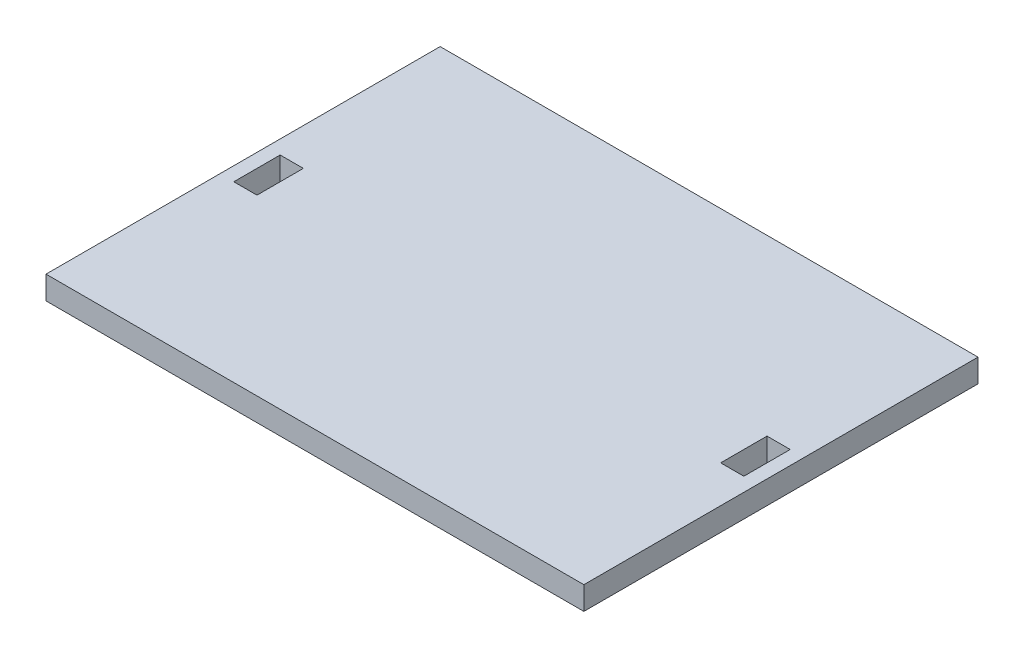
ISO-10303-21;
HEADER;
FILE_DESCRIPTION(('STEP AP214'),'2;1');
FILE_NAME('part.step','',(''),(''),'','','');
FILE_SCHEMA(('AUTOMOTIVE_DESIGN { 1 0 10303 214 1 1 1 1 }'));
ENDSEC;
DATA;
#1=APPLICATION_CONTEXT('core data for automotive mechanical design processes');
#2=APPLICATION_PROTOCOL_DEFINITION('international standard','automotive_design',2000,#1);
#3=PRODUCT_CONTEXT('',#1,'mechanical');
#4=PRODUCT('Part','Part','',(#3));
#5=PRODUCT_RELATED_PRODUCT_CATEGORY('part','',(#4));
#6=PRODUCT_DEFINITION_FORMATION('','',#4);
#7=PRODUCT_DEFINITION_CONTEXT('part definition',#1,'design');
#8=PRODUCT_DEFINITION('design','',#6,#7);
#9=PRODUCT_DEFINITION_SHAPE('','',#8);
#10=(LENGTH_UNIT() NAMED_UNIT(*) SI_UNIT(.MILLI.,.METRE.));
#11=(NAMED_UNIT(*) PLANE_ANGLE_UNIT() SI_UNIT($,.RADIAN.));
#12=(NAMED_UNIT(*) SI_UNIT($,.STERADIAN.) SOLID_ANGLE_UNIT());
#13=UNCERTAINTY_MEASURE_WITH_UNIT(LENGTH_MEASURE(1.E-05),#10,'distance_accuracy_value','');
#14=(GEOMETRIC_REPRESENTATION_CONTEXT(3) GLOBAL_UNCERTAINTY_ASSIGNED_CONTEXT((#13)) GLOBAL_UNIT_ASSIGNED_CONTEXT((#10,
#11,#12)) REPRESENTATION_CONTEXT('',''));
#15=CARTESIAN_POINT('',(0.,0.,0.));
#16=DIRECTION('',(0.,0.,1.));
#17=DIRECTION('',(1.,0.,0.));
#18=AXIS2_PLACEMENT_3D('',#15,#16,#17);
#19=CARTESIAN_POINT('',(58.,5.,42.5));
#20=DIRECTION('',(-1.,0.,0.));
#21=DIRECTION('',(0.,0.,1.));
#22=AXIS2_PLACEMENT_3D('',#19,#20,#21);
#23=PLANE('',#22);
#24=DIRECTION('',(0.,0.,-1.));
#25=VECTOR('',#24,1.);
#26=CARTESIAN_POINT('',(58.,0.,42.5));
#27=LINE('',#26,#25);
#28=CARTESIAN_POINT('',(58.,0.,42.5));
#29=VERTEX_POINT('',#28);
#30=CARTESIAN_POINT('',(58.,0.,-42.5));
#31=VERTEX_POINT('',#30);
#32=EDGE_CURVE('E166',#29,#31,#27,.T.);
#33=ORIENTED_EDGE('',*,*,#32,.T.);
#34=DIRECTION('',(0.,-1.,0.));
#35=VECTOR('',#34,1.);
#36=CARTESIAN_POINT('',(58.,5.,-42.5));
#37=LINE('',#36,#35);
#38=CARTESIAN_POINT('',(58.,5.,-42.5));
#39=VERTEX_POINT('',#38);
#40=EDGE_CURVE('E234',#39,#31,#37,.T.);
#41=ORIENTED_EDGE('',*,*,#40,.F.);
#42=DIRECTION('',(0.,0.,-1.));
#43=VECTOR('',#42,1.);
#44=CARTESIAN_POINT('',(58.,5.,42.5));
#45=LINE('',#44,#43);
#46=CARTESIAN_POINT('',(58.,5.,42.5));
#47=VERTEX_POINT('',#46);
#48=EDGE_CURVE('E197',#47,#39,#45,.T.);
#49=ORIENTED_EDGE('',*,*,#48,.F.);
#50=DIRECTION('',(0.,-1.,0.));
#51=VECTOR('',#50,1.);
#52=CARTESIAN_POINT('',(58.,5.,42.5));
#53=LINE('',#52,#51);
#54=EDGE_CURVE('E211',#47,#29,#53,.T.);
#55=ORIENTED_EDGE('',*,*,#54,.T.);
#56=EDGE_LOOP('',(#33,#41,#49,#55));
#57=FACE_BOUND('',#56,.T.);
#58=ADVANCED_FACE('F42',(#57),#23,.F.);
#59=CARTESIAN_POINT('',(-58.,5.,-42.5));
#60=DIRECTION('',(0.,0.,1.));
#61=DIRECTION('',(1.,0.,0.));
#62=AXIS2_PLACEMENT_3D('',#59,#60,#61);
#63=PLANE('',#62);
#64=DIRECTION('',(-1.,0.,0.));
#65=VECTOR('',#64,1.);
#66=CARTESIAN_POINT('',(-58.,0.,-42.5));
#67=LINE('',#66,#65);
#68=CARTESIAN_POINT('',(-58.,0.,-42.5));
#69=VERTEX_POINT('',#68);
#70=EDGE_CURVE('E215',#31,#69,#67,.T.);
#71=ORIENTED_EDGE('',*,*,#70,.T.);
#72=DIRECTION('',(0.,-1.,0.));
#73=VECTOR('',#72,1.);
#74=CARTESIAN_POINT('',(-58.,5.,-42.5));
#75=LINE('',#74,#73);
#76=CARTESIAN_POINT('',(-58.,5.,-42.5));
#77=VERTEX_POINT('',#76);
#78=EDGE_CURVE('E230',#77,#69,#75,.T.);
#79=ORIENTED_EDGE('',*,*,#78,.F.);
#80=DIRECTION('',(-1.,0.,0.));
#81=VECTOR('',#80,1.);
#82=CARTESIAN_POINT('',(-58.,5.,-42.5));
#83=LINE('',#82,#81);
#84=EDGE_CURVE('E201',#39,#77,#83,.T.);
#85=ORIENTED_EDGE('',*,*,#84,.F.);
#86=ORIENTED_EDGE('',*,*,#40,.T.);
#87=EDGE_LOOP('',(#71,#79,#85,#86));
#88=FACE_BOUND('',#87,.T.);
#89=ADVANCED_FACE('F280',(#88),#63,.F.);
#90=CARTESIAN_POINT('',(-58.,5.,42.5));
#91=DIRECTION('',(1.,0.,0.));
#92=DIRECTION('',(0.,0.,-1.));
#93=AXIS2_PLACEMENT_3D('',#90,#91,#92);
#94=PLANE('',#93);
#95=DIRECTION('',(0.,0.,1.));
#96=VECTOR('',#95,1.);
#97=CARTESIAN_POINT('',(-58.,0.,42.5));
#98=LINE('',#97,#96);
#99=CARTESIAN_POINT('',(-58.,0.,42.5));
#100=VERTEX_POINT('',#99);
#101=EDGE_CURVE('E218',#69,#100,#98,.T.);
#102=ORIENTED_EDGE('',*,*,#101,.T.);
#103=DIRECTION('',(0.,-1.,0.));
#104=VECTOR('',#103,1.);
#105=CARTESIAN_POINT('',(-58.,5.,42.5));
#106=LINE('',#105,#104);
#107=CARTESIAN_POINT('',(-58.,5.,42.5));
#108=VERTEX_POINT('',#107);
#109=EDGE_CURVE('E226',#108,#100,#106,.T.);
#110=ORIENTED_EDGE('',*,*,#109,.F.);
#111=DIRECTION('',(0.,0.,1.));
#112=VECTOR('',#111,1.);
#113=CARTESIAN_POINT('',(-58.,5.,42.5));
#114=LINE('',#113,#112);
#115=EDGE_CURVE('E205',#77,#108,#114,.T.);
#116=ORIENTED_EDGE('',*,*,#115,.F.);
#117=ORIENTED_EDGE('',*,*,#78,.T.);
#118=EDGE_LOOP('',(#102,#110,#116,#117));
#119=FACE_BOUND('',#118,.T.);
#120=ADVANCED_FACE('F285',(#119),#94,.F.);
#121=CARTESIAN_POINT('',(-58.,5.,42.5));
#122=DIRECTION('',(0.,0.,-1.));
#123=DIRECTION('',(-1.,0.,0.));
#124=AXIS2_PLACEMENT_3D('',#121,#122,#123);
#125=PLANE('',#124);
#126=DIRECTION('',(1.,0.,0.));
#127=VECTOR('',#126,1.);
#128=CARTESIAN_POINT('',(-58.,0.,42.5));
#129=LINE('',#128,#127);
#130=EDGE_CURVE('E202',#100,#29,#129,.T.);
#131=ORIENTED_EDGE('',*,*,#130,.T.);
#132=ORIENTED_EDGE('',*,*,#54,.F.);
#133=DIRECTION('',(1.,0.,0.));
#134=VECTOR('',#133,1.);
#135=CARTESIAN_POINT('',(-58.,5.,42.5));
#136=LINE('',#135,#134);
#137=EDGE_CURVE('E208',#108,#47,#136,.T.);
#138=ORIENTED_EDGE('',*,*,#137,.F.);
#139=ORIENTED_EDGE('',*,*,#109,.T.);
#140=EDGE_LOOP('',(#131,#132,#138,#139));
#141=FACE_BOUND('',#140,.T.);
#142=ADVANCED_FACE('F300',(#141),#125,.F.);
#143=CARTESIAN_POINT('',(0.,5.,0.));
#144=DIRECTION('',(0.,-1.,0.));
#145=DIRECTION('',(0.,0.,-1.));
#146=AXIS2_PLACEMENT_3D('',#143,#144,#145);
#147=PLANE('',#146);
#148=DIRECTION('',(1.,0.,0.));
#149=VECTOR('',#148,1.);
#150=CARTESIAN_POINT('',(-55.,5.,5.));
#151=LINE('',#150,#149);
#152=CARTESIAN_POINT('',(-55.,5.,5.));
#153=VERTEX_POINT('',#152);
#154=CARTESIAN_POINT('',(-50.,5.,5.));
#155=VERTEX_POINT('',#154);
#156=EDGE_CURVE('E148',#153,#155,#151,.T.);
#157=ORIENTED_EDGE('',*,*,#156,.F.);
#158=DIRECTION('',(0.,0.,1.));
#159=VECTOR('',#158,1.);
#160=CARTESIAN_POINT('',(-55.,5.,-5.));
#161=LINE('',#160,#159);
#162=CARTESIAN_POINT('',(-55.,5.,-5.));
#163=VERTEX_POINT('',#162);
#164=EDGE_CURVE('E57',#163,#153,#161,.T.);
#165=ORIENTED_EDGE('',*,*,#164,.F.);
#166=DIRECTION('',(-1.,0.,0.));
#167=VECTOR('',#166,1.);
#168=CARTESIAN_POINT('',(-55.,5.,-5.));
#169=LINE('',#168,#167);
#170=CARTESIAN_POINT('',(-50.,5.,-5.));
#171=VERTEX_POINT('',#170);
#172=EDGE_CURVE('E156',#171,#163,#169,.T.);
#173=ORIENTED_EDGE('',*,*,#172,.F.);
#174=DIRECTION('',(0.,0.,-1.));
#175=VECTOR('',#174,1.);
#176=CARTESIAN_POINT('',(-50.,5.,-5.));
#177=LINE('',#176,#175);
#178=EDGE_CURVE('E137',#155,#171,#177,.T.);
#179=ORIENTED_EDGE('',*,*,#178,.F.);
#180=EDGE_LOOP('',(#157,#165,#173,#179));
#181=FACE_BOUND('',#180,.T.);
#182=DIRECTION('',(0.,0.,1.));
#183=VECTOR('',#182,1.);
#184=CARTESIAN_POINT('',(50.,5.,-5.));
#185=LINE('',#184,#183);
#186=CARTESIAN_POINT('',(50.,5.,-5.));
#187=VERTEX_POINT('',#186);
#188=CARTESIAN_POINT('',(50.,5.,5.));
#189=VERTEX_POINT('',#188);
#190=EDGE_CURVE('E191',#187,#189,#185,.T.);
#191=ORIENTED_EDGE('',*,*,#190,.F.);
#192=DIRECTION('',(-1.,0.,0.));
#193=VECTOR('',#192,1.);
#194=CARTESIAN_POINT('',(55.,5.,-5.));
#195=LINE('',#194,#193);
#196=CARTESIAN_POINT('',(55.,5.,-5.));
#197=VERTEX_POINT('',#196);
#198=EDGE_CURVE('E65',#197,#187,#195,.T.);
#199=ORIENTED_EDGE('',*,*,#198,.F.);
#200=DIRECTION('',(0.,0.,-1.));
#201=VECTOR('',#200,1.);
#202=CARTESIAN_POINT('',(55.,5.,-5.));
#203=LINE('',#202,#201);
#204=CARTESIAN_POINT('',(55.,5.,5.));
#205=VERTEX_POINT('',#204);
#206=EDGE_CURVE('E174',#205,#197,#203,.T.);
#207=ORIENTED_EDGE('',*,*,#206,.F.);
#208=DIRECTION('',(1.,0.,0.));
#209=VECTOR('',#208,1.);
#210=CARTESIAN_POINT('',(55.,5.,5.));
#211=LINE('',#210,#209);
#212=EDGE_CURVE('E187',#189,#205,#211,.T.);
#213=ORIENTED_EDGE('',*,*,#212,.F.);
#214=EDGE_LOOP('',(#191,#199,#207,#213));
#215=FACE_BOUND('',#214,.T.);
#216=ORIENTED_EDGE('',*,*,#48,.T.);
#217=ORIENTED_EDGE('',*,*,#84,.T.);
#218=ORIENTED_EDGE('',*,*,#115,.T.);
#219=ORIENTED_EDGE('',*,*,#137,.T.);
#220=EDGE_LOOP('',(#216,#217,#218,#219));
#221=FACE_BOUND('',#220,.T.);
#222=ADVANCED_FACE('F153',(#181,#215,#221),#147,.F.);
#223=CARTESIAN_POINT('',(0.,0.,0.));
#224=DIRECTION('',(0.,-1.,0.));
#225=DIRECTION('',(0.,0.,-1.));
#226=AXIS2_PLACEMENT_3D('',#223,#224,#225);
#227=PLANE('',#226);
#228=DIRECTION('',(0.,0.,-1.));
#229=VECTOR('',#228,1.);
#230=CARTESIAN_POINT('',(-55.,0.,0.));
#231=LINE('',#230,#229);
#232=CARTESIAN_POINT('',(-55.,0.,5.));
#233=VERTEX_POINT('',#232);
#234=CARTESIAN_POINT('',(-55.,0.,-5.));
#235=VERTEX_POINT('',#234);
#236=EDGE_CURVE('E11',#233,#235,#231,.T.);
#237=ORIENTED_EDGE('',*,*,#236,.F.);
#238=DIRECTION('',(-1.,0.,0.));
#239=VECTOR('',#238,1.);
#240=CARTESIAN_POINT('',(0.,0.,5.));
#241=LINE('',#240,#239);
#242=CARTESIAN_POINT('',(-50.,0.,5.));
#243=VERTEX_POINT('',#242);
#244=EDGE_CURVE('E251',#243,#233,#241,.T.);
#245=ORIENTED_EDGE('',*,*,#244,.F.);
#246=DIRECTION('',(0.,0.,1.));
#247=VECTOR('',#246,1.);
#248=CARTESIAN_POINT('',(-50.,0.,0.));
#249=LINE('',#248,#247);
#250=CARTESIAN_POINT('',(-50.,0.,-5.));
#251=VERTEX_POINT('',#250);
#252=EDGE_CURVE('E140',#251,#243,#249,.T.);
#253=ORIENTED_EDGE('',*,*,#252,.F.);
#254=DIRECTION('',(1.,0.,0.));
#255=VECTOR('',#254,1.);
#256=CARTESIAN_POINT('',(0.,0.,-5.));
#257=LINE('',#256,#255);
#258=EDGE_CURVE('E50',#235,#251,#257,.T.);
#259=ORIENTED_EDGE('',*,*,#258,.F.);
#260=EDGE_LOOP('',(#237,#245,#253,#259));
#261=FACE_BOUND('',#260,.T.);
#262=DIRECTION('',(1.,0.,0.));
#263=VECTOR('',#262,1.);
#264=CARTESIAN_POINT('',(0.,0.,-5.));
#265=LINE('',#264,#263);
#266=CARTESIAN_POINT('',(50.,0.,-5.));
#267=VERTEX_POINT('',#266);
#268=CARTESIAN_POINT('',(55.,0.,-5.));
#269=VERTEX_POINT('',#268);
#270=EDGE_CURVE('E248',#267,#269,#265,.T.);
#271=ORIENTED_EDGE('',*,*,#270,.F.);
#272=DIRECTION('',(0.,0.,-1.));
#273=VECTOR('',#272,1.);
#274=CARTESIAN_POINT('',(50.,0.,0.));
#275=LINE('',#274,#273);
#276=CARTESIAN_POINT('',(50.,0.,5.));
#277=VERTEX_POINT('',#276);
#278=EDGE_CURVE('E238',#277,#267,#275,.T.);
#279=ORIENTED_EDGE('',*,*,#278,.F.);
#280=DIRECTION('',(-1.,0.,0.));
#281=VECTOR('',#280,1.);
#282=CARTESIAN_POINT('',(0.,0.,5.));
#283=LINE('',#282,#281);
#284=CARTESIAN_POINT('',(55.,0.,5.));
#285=VERTEX_POINT('',#284);
#286=EDGE_CURVE('E241',#285,#277,#283,.T.);
#287=ORIENTED_EDGE('',*,*,#286,.F.);
#288=DIRECTION('',(0.,0.,1.));
#289=VECTOR('',#288,1.);
#290=CARTESIAN_POINT('',(55.,0.,0.));
#291=LINE('',#290,#289);
#292=EDGE_CURVE('E245',#269,#285,#291,.T.);
#293=ORIENTED_EDGE('',*,*,#292,.F.);
#294=EDGE_LOOP('',(#271,#279,#287,#293));
#295=FACE_BOUND('',#294,.T.);
#296=ORIENTED_EDGE('',*,*,#32,.F.);
#297=ORIENTED_EDGE('',*,*,#130,.F.);
#298=ORIENTED_EDGE('',*,*,#101,.F.);
#299=ORIENTED_EDGE('',*,*,#70,.F.);
#300=EDGE_LOOP('',(#296,#297,#298,#299));
#301=FACE_BOUND('',#300,.T.);
#302=ADVANCED_FACE('F262',(#261,#295,#301),#227,.T.);
#303=CARTESIAN_POINT('',(55.,-5.,-5.));
#304=DIRECTION('',(0.,0.,-1.));
#305=DIRECTION('',(-1.,0.,0.));
#306=AXIS2_PLACEMENT_3D('',#303,#304,#305);
#307=PLANE('',#306);
#308=ORIENTED_EDGE('',*,*,#270,.T.);
#309=DIRECTION('',(0.,1.,0.));
#310=VECTOR('',#309,1.);
#311=CARTESIAN_POINT('',(55.,-5.,-5.));
#312=LINE('',#311,#310);
#313=EDGE_CURVE('E181',#269,#197,#312,.T.);
#314=ORIENTED_EDGE('',*,*,#313,.T.);
#315=ORIENTED_EDGE('',*,*,#198,.T.);
#316=DIRECTION('',(0.,1.,0.));
#317=VECTOR('',#316,1.);
#318=CARTESIAN_POINT('',(50.,-5.,-5.));
#319=LINE('',#318,#317);
#320=EDGE_CURVE('E171',#267,#187,#319,.T.);
#321=ORIENTED_EDGE('',*,*,#320,.F.);
#322=EDGE_LOOP('',(#308,#314,#315,#321));
#323=FACE_BOUND('',#322,.T.);
#324=ADVANCED_FACE('F311',(#323),#307,.F.);
#325=CARTESIAN_POINT('',(55.,-5.,-5.));
#326=DIRECTION('',(1.,0.,0.));
#327=DIRECTION('',(0.,0.,-1.));
#328=AXIS2_PLACEMENT_3D('',#325,#326,#327);
#329=PLANE('',#328);
#330=ORIENTED_EDGE('',*,*,#292,.T.);
#331=DIRECTION('',(0.,1.,0.));
#332=VECTOR('',#331,1.);
#333=CARTESIAN_POINT('',(55.,-5.,5.));
#334=LINE('',#333,#332);
#335=EDGE_CURVE('E178',#285,#205,#334,.T.);
#336=ORIENTED_EDGE('',*,*,#335,.T.);
#337=ORIENTED_EDGE('',*,*,#206,.T.);
#338=ORIENTED_EDGE('',*,*,#313,.F.);
#339=EDGE_LOOP('',(#330,#336,#337,#338));
#340=FACE_BOUND('',#339,.T.);
#341=ADVANCED_FACE('F314',(#340),#329,.F.);
#342=CARTESIAN_POINT('',(55.,-5.,5.));
#343=DIRECTION('',(0.,0.,1.));
#344=DIRECTION('',(1.,0.,0.));
#345=AXIS2_PLACEMENT_3D('',#342,#343,#344);
#346=PLANE('',#345);
#347=ORIENTED_EDGE('',*,*,#286,.T.);
#348=DIRECTION('',(0.,1.,0.));
#349=VECTOR('',#348,1.);
#350=CARTESIAN_POINT('',(50.,-5.,5.));
#351=LINE('',#350,#349);
#352=EDGE_CURVE('E175',#277,#189,#351,.T.);
#353=ORIENTED_EDGE('',*,*,#352,.T.);
#354=ORIENTED_EDGE('',*,*,#212,.T.);
#355=ORIENTED_EDGE('',*,*,#335,.F.);
#356=EDGE_LOOP('',(#347,#353,#354,#355));
#357=FACE_BOUND('',#356,.T.);
#358=ADVANCED_FACE('F274',(#357),#346,.F.);
#359=CARTESIAN_POINT('',(50.,-5.,-5.));
#360=DIRECTION('',(-1.,0.,0.));
#361=DIRECTION('',(0.,0.,1.));
#362=AXIS2_PLACEMENT_3D('',#359,#360,#361);
#363=PLANE('',#362);
#364=ORIENTED_EDGE('',*,*,#278,.T.);
#365=ORIENTED_EDGE('',*,*,#320,.T.);
#366=ORIENTED_EDGE('',*,*,#190,.T.);
#367=ORIENTED_EDGE('',*,*,#352,.F.);
#368=EDGE_LOOP('',(#364,#365,#366,#367));
#369=FACE_BOUND('',#368,.T.);
#370=ADVANCED_FACE('F267',(#369),#363,.F.);
#371=CARTESIAN_POINT('',(-55.,-5.,-5.));
#372=DIRECTION('',(-1.,0.,0.));
#373=DIRECTION('',(0.,0.,1.));
#374=AXIS2_PLACEMENT_3D('',#371,#372,#373);
#375=PLANE('',#374);
#376=ORIENTED_EDGE('',*,*,#236,.T.);
#377=DIRECTION('',(0.,1.,0.));
#378=VECTOR('',#377,1.);
#379=CARTESIAN_POINT('',(-55.,-5.,-5.));
#380=LINE('',#379,#378);
#381=EDGE_CURVE('E163',#235,#163,#380,.T.);
#382=ORIENTED_EDGE('',*,*,#381,.T.);
#383=ORIENTED_EDGE('',*,*,#164,.T.);
#384=DIRECTION('',(0.,1.,0.));
#385=VECTOR('',#384,1.);
#386=CARTESIAN_POINT('',(-55.,-5.,5.));
#387=LINE('',#386,#385);
#388=EDGE_CURVE('E145',#233,#153,#387,.T.);
#389=ORIENTED_EDGE('',*,*,#388,.F.);
#390=EDGE_LOOP('',(#376,#382,#383,#389));
#391=FACE_BOUND('',#390,.T.);
#392=ADVANCED_FACE('F264',(#391),#375,.F.);
#393=CARTESIAN_POINT('',(-55.,-5.,-5.));
#394=DIRECTION('',(0.,0.,-1.));
#395=DIRECTION('',(-1.,0.,0.));
#396=AXIS2_PLACEMENT_3D('',#393,#394,#395);
#397=PLANE('',#396);
#398=ORIENTED_EDGE('',*,*,#258,.T.);
#399=DIRECTION('',(0.,1.,0.));
#400=VECTOR('',#399,1.);
#401=CARTESIAN_POINT('',(-50.,-5.,-5.));
#402=LINE('',#401,#400);
#403=EDGE_CURVE('E144',#251,#171,#402,.T.);
#404=ORIENTED_EDGE('',*,*,#403,.T.);
#405=ORIENTED_EDGE('',*,*,#172,.T.);
#406=ORIENTED_EDGE('',*,*,#381,.F.);
#407=EDGE_LOOP('',(#398,#404,#405,#406));
#408=FACE_BOUND('',#407,.T.);
#409=ADVANCED_FACE('F259',(#408),#397,.F.);
#410=CARTESIAN_POINT('',(-50.,-5.,-5.));
#411=DIRECTION('',(1.,0.,0.));
#412=DIRECTION('',(0.,0.,-1.));
#413=AXIS2_PLACEMENT_3D('',#410,#411,#412);
#414=PLANE('',#413);
#415=ORIENTED_EDGE('',*,*,#252,.T.);
#416=DIRECTION('',(0.,1.,0.));
#417=VECTOR('',#416,1.);
#418=CARTESIAN_POINT('',(-50.,-5.,5.));
#419=LINE('',#418,#417);
#420=EDGE_CURVE('E132',#243,#155,#419,.T.);
#421=ORIENTED_EDGE('',*,*,#420,.T.);
#422=ORIENTED_EDGE('',*,*,#178,.T.);
#423=ORIENTED_EDGE('',*,*,#403,.F.);
#424=EDGE_LOOP('',(#415,#421,#422,#423));
#425=FACE_BOUND('',#424,.T.);
#426=ADVANCED_FACE('F134',(#425),#414,.F.);
#427=CARTESIAN_POINT('',(-55.,-5.,5.));
#428=DIRECTION('',(0.,0.,1.));
#429=DIRECTION('',(1.,0.,0.));
#430=AXIS2_PLACEMENT_3D('',#427,#428,#429);
#431=PLANE('',#430);
#432=ORIENTED_EDGE('',*,*,#244,.T.);
#433=ORIENTED_EDGE('',*,*,#388,.T.);
#434=ORIENTED_EDGE('',*,*,#156,.T.);
#435=ORIENTED_EDGE('',*,*,#420,.F.);
#436=EDGE_LOOP('',(#432,#433,#434,#435));
#437=FACE_BOUND('',#436,.T.);
#438=ADVANCED_FACE('F149',(#437),#431,.F.);
#439=CLOSED_SHELL('',(#58,#89,#120,#142,#222,#302,#324,#341,#358,#370,#392,#409,#426,#438));
#440=MANIFOLD_SOLID_BREP('B2',#439);
#441=ADVANCED_BREP_SHAPE_REPRESENTATION('',(#18,#440),#14);
#442=SHAPE_DEFINITION_REPRESENTATION(#9,#441);
ENDSEC;
END-ISO-10303-21;
